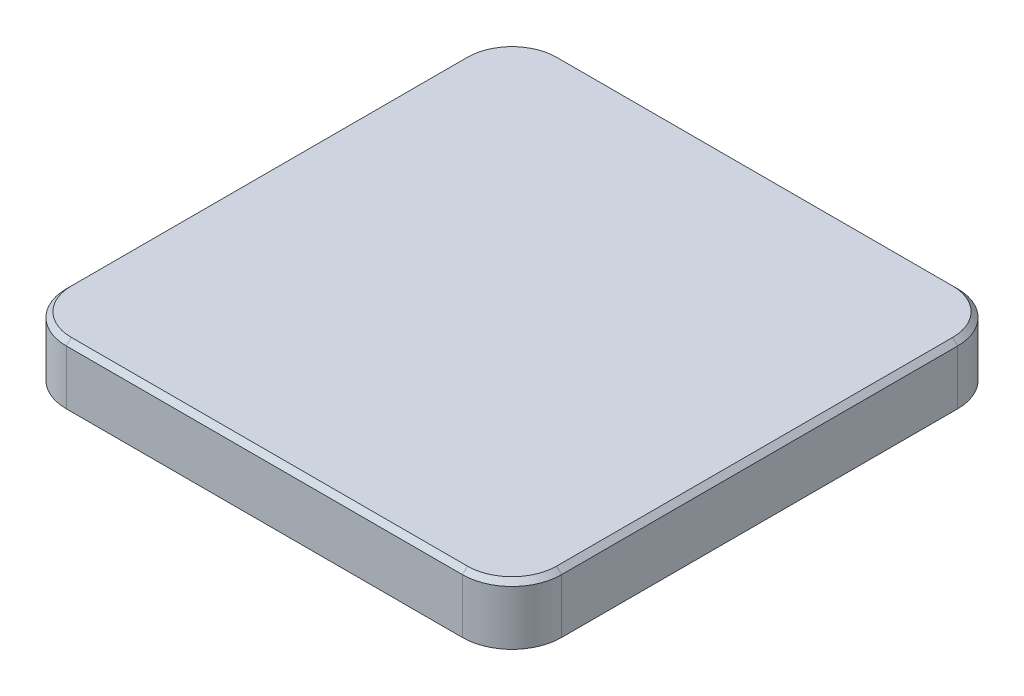
ISO-10303-21;
HEADER;
FILE_DESCRIPTION(('STEP AP214'),'2;1');
FILE_NAME('part.step','',(''),(''),'','','');
FILE_SCHEMA(('AUTOMOTIVE_DESIGN { 1 0 10303 214 1 1 1 1 }'));
ENDSEC;
DATA;
#1=APPLICATION_CONTEXT('core data for automotive mechanical design processes');
#2=APPLICATION_PROTOCOL_DEFINITION('international standard','automotive_design',2000,#1);
#3=PRODUCT_CONTEXT('',#1,'mechanical');
#4=PRODUCT('Part','Part','',(#3));
#5=PRODUCT_RELATED_PRODUCT_CATEGORY('part','',(#4));
#6=PRODUCT_DEFINITION_FORMATION('','',#4);
#7=PRODUCT_DEFINITION_CONTEXT('part definition',#1,'design');
#8=PRODUCT_DEFINITION('design','',#6,#7);
#9=PRODUCT_DEFINITION_SHAPE('','',#8);
#10=(LENGTH_UNIT() NAMED_UNIT(*) SI_UNIT(.MILLI.,.METRE.));
#11=(NAMED_UNIT(*) PLANE_ANGLE_UNIT() SI_UNIT($,.RADIAN.));
#12=(NAMED_UNIT(*) SI_UNIT($,.STERADIAN.) SOLID_ANGLE_UNIT());
#13=UNCERTAINTY_MEASURE_WITH_UNIT(LENGTH_MEASURE(1.E-05),#10,'distance_accuracy_value','');
#14=(GEOMETRIC_REPRESENTATION_CONTEXT(3) GLOBAL_UNCERTAINTY_ASSIGNED_CONTEXT((#13)) GLOBAL_UNIT_ASSIGNED_CONTEXT((#10,
#11,#12)) REPRESENTATION_CONTEXT('',''));
#15=CARTESIAN_POINT('',(0.,0.,0.));
#16=DIRECTION('',(0.,0.,1.));
#17=DIRECTION('',(1.,0.,0.));
#18=AXIS2_PLACEMENT_3D('',#15,#16,#17);
#19=CARTESIAN_POINT('',(40.,12.,-40.));
#20=DIRECTION('',(0.,-1.,0.));
#21=DIRECTION('',(0.,0.,-1.));
#22=AXIS2_PLACEMENT_3D('',#19,#20,#21);
#23=CYLINDRICAL_SURFACE('',#22,10.);
#24=DIRECTION('',(0.,-1.,0.));
#25=VECTOR('',#24,1.);
#26=CARTESIAN_POINT('',(39.9999999999999,12.,-50.));
#27=LINE('',#26,#25);
#28=CARTESIAN_POINT('',(39.9999999999999,11.,-50.));
#29=VERTEX_POINT('',#28);
#30=CARTESIAN_POINT('',(39.9999999999999,0.,-50.));
#31=VERTEX_POINT('',#30);
#32=EDGE_CURVE('E125',#29,#31,#27,.T.);
#33=ORIENTED_EDGE('',*,*,#32,.F.);
#34=CARTESIAN_POINT('',(40.,11.,-40.));
#35=DIRECTION('',(0.,-1.,0.));
#36=DIRECTION('',(0.,0.,-1.));
#37=AXIS2_PLACEMENT_3D('',#34,#35,#36);
#38=CIRCLE('',#37,10.);
#39=CARTESIAN_POINT('',(50.,11.,-39.9999999999999));
#40=VERTEX_POINT('',#39);
#41=EDGE_CURVE('E198',#29,#40,#38,.T.);
#42=ORIENTED_EDGE('',*,*,#41,.T.);
#43=DIRECTION('',(0.,-1.,0.));
#44=VECTOR('',#43,1.);
#45=CARTESIAN_POINT('',(50.,12.,-39.9999999999999));
#46=LINE('',#45,#44);
#47=CARTESIAN_POINT('',(50.,0.,-39.9999999999999));
#48=VERTEX_POINT('',#47);
#49=EDGE_CURVE('E149',#40,#48,#46,.T.);
#50=ORIENTED_EDGE('',*,*,#49,.T.);
#51=CARTESIAN_POINT('',(40.,0.,-40.));
#52=DIRECTION('',(0.,1.,0.));
#53=DIRECTION('',(0.,0.,-1.));
#54=AXIS2_PLACEMENT_3D('',#51,#52,#53);
#55=CIRCLE('',#54,10.);
#56=EDGE_CURVE('E144',#48,#31,#55,.T.);
#57=ORIENTED_EDGE('',*,*,#56,.T.);
#58=EDGE_LOOP('',(#33,#42,#50,#57));
#59=FACE_BOUND('',#58,.T.);
#60=ADVANCED_FACE('F35',(#59),#23,.T.);
#61=CARTESIAN_POINT('',(-40.,12.,-50.));
#62=DIRECTION('',(0.,0.,1.));
#63=DIRECTION('',(1.,0.,0.));
#64=AXIS2_PLACEMENT_3D('',#61,#62,#63);
#65=PLANE('',#64);
#66=DIRECTION('',(0.,-1.,0.));
#67=VECTOR('',#66,1.);
#68=CARTESIAN_POINT('',(-40.,12.,-50.));
#69=LINE('',#68,#67);
#70=CARTESIAN_POINT('',(-40.,11.,-50.));
#71=VERTEX_POINT('',#70);
#72=CARTESIAN_POINT('',(-40.,0.,-50.));
#73=VERTEX_POINT('',#72);
#74=EDGE_CURVE('E138',#71,#73,#69,.T.);
#75=ORIENTED_EDGE('',*,*,#74,.F.);
#76=DIRECTION('',(1.,0.,0.));
#77=VECTOR('',#76,1.);
#78=CARTESIAN_POINT('',(-40.,11.,-50.));
#79=LINE('',#78,#77);
#80=EDGE_CURVE('E132',#71,#29,#79,.T.);
#81=ORIENTED_EDGE('',*,*,#80,.T.);
#82=ORIENTED_EDGE('',*,*,#32,.T.);
#83=DIRECTION('',(-1.,0.,0.));
#84=VECTOR('',#83,1.);
#85=CARTESIAN_POINT('',(-40.,0.,-50.));
#86=LINE('',#85,#84);
#87=EDGE_CURVE('E129',#31,#73,#86,.T.);
#88=ORIENTED_EDGE('',*,*,#87,.T.);
#89=EDGE_LOOP('',(#75,#81,#82,#88));
#90=FACE_BOUND('',#89,.T.);
#91=ADVANCED_FACE('F128',(#90),#65,.F.);
#92=CARTESIAN_POINT('',(-40.,12.,-40.));
#93=DIRECTION('',(0.,-1.,0.));
#94=DIRECTION('',(0.,0.,-1.));
#95=AXIS2_PLACEMENT_3D('',#92,#93,#94);
#96=CYLINDRICAL_SURFACE('',#95,10.);
#97=DIRECTION('',(0.,-1.,0.));
#98=VECTOR('',#97,1.);
#99=CARTESIAN_POINT('',(-50.,12.,-39.9999999999999));
#100=LINE('',#99,#98);
#101=CARTESIAN_POINT('',(-50.,11.,-39.9999999999999));
#102=VERTEX_POINT('',#101);
#103=CARTESIAN_POINT('',(-50.,0.,-39.9999999999999));
#104=VERTEX_POINT('',#103);
#105=EDGE_CURVE('E179',#102,#104,#100,.T.);
#106=ORIENTED_EDGE('',*,*,#105,.F.);
#107=CARTESIAN_POINT('',(-40.,11.,-40.));
#108=DIRECTION('',(0.,-1.,0.));
#109=DIRECTION('',(0.,0.,-1.));
#110=AXIS2_PLACEMENT_3D('',#107,#108,#109);
#111=CIRCLE('',#110,10.);
#112=EDGE_CURVE('E201',#102,#71,#111,.T.);
#113=ORIENTED_EDGE('',*,*,#112,.T.);
#114=ORIENTED_EDGE('',*,*,#74,.T.);
#115=CARTESIAN_POINT('',(-40.,0.,-40.));
#116=DIRECTION('',(0.,1.,0.));
#117=DIRECTION('',(0.,0.,1.));
#118=AXIS2_PLACEMENT_3D('',#115,#116,#117);
#119=CIRCLE('',#118,10.);
#120=EDGE_CURVE('E147',#73,#104,#119,.T.);
#121=ORIENTED_EDGE('',*,*,#120,.T.);
#122=EDGE_LOOP('',(#106,#113,#114,#121));
#123=FACE_BOUND('',#122,.T.);
#124=ADVANCED_FACE('F269',(#123),#96,.T.);
#125=CARTESIAN_POINT('',(-50.,12.,-39.9999999999999));
#126=DIRECTION('',(1.,0.,0.));
#127=DIRECTION('',(0.,0.,-1.));
#128=AXIS2_PLACEMENT_3D('',#125,#126,#127);
#129=PLANE('',#128);
#130=DIRECTION('',(0.,-1.,0.));
#131=VECTOR('',#130,1.);
#132=CARTESIAN_POINT('',(-50.,12.,39.9999999999999));
#133=LINE('',#132,#131);
#134=CARTESIAN_POINT('',(-50.,11.,39.9999999999999));
#135=VERTEX_POINT('',#134);
#136=CARTESIAN_POINT('',(-50.,0.,39.9999999999999));
#137=VERTEX_POINT('',#136);
#138=EDGE_CURVE('E177',#135,#137,#133,.T.);
#139=ORIENTED_EDGE('',*,*,#138,.F.);
#140=DIRECTION('',(0.,0.,-1.));
#141=VECTOR('',#140,1.);
#142=CARTESIAN_POINT('',(-50.,11.,-39.9999999999999));
#143=LINE('',#142,#141);
#144=EDGE_CURVE('E203',#135,#102,#143,.T.);
#145=ORIENTED_EDGE('',*,*,#144,.T.);
#146=ORIENTED_EDGE('',*,*,#105,.T.);
#147=DIRECTION('',(0.,0.,1.));
#148=VECTOR('',#147,1.);
#149=CARTESIAN_POINT('',(-50.,0.,-39.9999999999999));
#150=LINE('',#149,#148);
#151=EDGE_CURVE('E156',#104,#137,#150,.T.);
#152=ORIENTED_EDGE('',*,*,#151,.T.);
#153=EDGE_LOOP('',(#139,#145,#146,#152));
#154=FACE_BOUND('',#153,.T.);
#155=ADVANCED_FACE('F266',(#154),#129,.F.);
#156=CARTESIAN_POINT('',(-40.,12.,40.));
#157=DIRECTION('',(0.,-1.,0.));
#158=DIRECTION('',(0.,0.,-1.));
#159=AXIS2_PLACEMENT_3D('',#156,#157,#158);
#160=CYLINDRICAL_SURFACE('',#159,10.);
#161=DIRECTION('',(0.,-1.,0.));
#162=VECTOR('',#161,1.);
#163=CARTESIAN_POINT('',(-40.,12.,50.));
#164=LINE('',#163,#162);
#165=CARTESIAN_POINT('',(-40.,11.,50.));
#166=VERTEX_POINT('',#165);
#167=CARTESIAN_POINT('',(-40.,0.,50.));
#168=VERTEX_POINT('',#167);
#169=EDGE_CURVE('E175',#166,#168,#164,.T.);
#170=ORIENTED_EDGE('',*,*,#169,.F.);
#171=CARTESIAN_POINT('',(-40.,11.,40.));
#172=DIRECTION('',(0.,-1.,0.));
#173=DIRECTION('',(0.,0.,-1.));
#174=AXIS2_PLACEMENT_3D('',#171,#172,#173);
#175=CIRCLE('',#174,10.);
#176=EDGE_CURVE('E205',#166,#135,#175,.T.);
#177=ORIENTED_EDGE('',*,*,#176,.T.);
#178=ORIENTED_EDGE('',*,*,#138,.T.);
#179=CARTESIAN_POINT('',(-40.,0.,40.));
#180=DIRECTION('',(0.,1.,0.));
#181=DIRECTION('',(0.,0.,1.));
#182=AXIS2_PLACEMENT_3D('',#179,#180,#181);
#183=CIRCLE('',#182,10.);
#184=EDGE_CURVE('E159',#137,#168,#183,.T.);
#185=ORIENTED_EDGE('',*,*,#184,.T.);
#186=EDGE_LOOP('',(#170,#177,#178,#185));
#187=FACE_BOUND('',#186,.T.);
#188=ADVANCED_FACE('F263',(#187),#160,.T.);
#189=CARTESIAN_POINT('',(-39.9999999999999,12.,50.));
#190=DIRECTION('',(0.,0.,-1.));
#191=DIRECTION('',(-1.,0.,0.));
#192=AXIS2_PLACEMENT_3D('',#189,#190,#191);
#193=PLANE('',#192);
#194=DIRECTION('',(0.,-1.,0.));
#195=VECTOR('',#194,1.);
#196=CARTESIAN_POINT('',(39.9999999999999,12.,50.));
#197=LINE('',#196,#195);
#198=CARTESIAN_POINT('',(39.9999999999999,11.,50.));
#199=VERTEX_POINT('',#198);
#200=CARTESIAN_POINT('',(39.9999999999999,0.,50.));
#201=VERTEX_POINT('',#200);
#202=EDGE_CURVE('E173',#199,#201,#197,.T.);
#203=ORIENTED_EDGE('',*,*,#202,.F.);
#204=DIRECTION('',(-1.,0.,0.));
#205=VECTOR('',#204,1.);
#206=CARTESIAN_POINT('',(-39.9999999999999,11.,50.));
#207=LINE('',#206,#205);
#208=EDGE_CURVE('E207',#199,#166,#207,.T.);
#209=ORIENTED_EDGE('',*,*,#208,.T.);
#210=ORIENTED_EDGE('',*,*,#169,.T.);
#211=DIRECTION('',(1.,0.,0.));
#212=VECTOR('',#211,1.);
#213=CARTESIAN_POINT('',(-39.9999999999999,0.,50.));
#214=LINE('',#213,#212);
#215=EDGE_CURVE('E162',#168,#201,#214,.T.);
#216=ORIENTED_EDGE('',*,*,#215,.T.);
#217=EDGE_LOOP('',(#203,#209,#210,#216));
#218=FACE_BOUND('',#217,.T.);
#219=ADVANCED_FACE('F260',(#218),#193,.F.);
#220=CARTESIAN_POINT('',(40.,12.,40.));
#221=DIRECTION('',(0.,-1.,0.));
#222=DIRECTION('',(0.,0.,-1.));
#223=AXIS2_PLACEMENT_3D('',#220,#221,#222);
#224=CYLINDRICAL_SURFACE('',#223,10.);
#225=DIRECTION('',(0.,-1.,0.));
#226=VECTOR('',#225,1.);
#227=CARTESIAN_POINT('',(50.,12.,39.9999999999999));
#228=LINE('',#227,#226);
#229=CARTESIAN_POINT('',(50.,11.,39.9999999999999));
#230=VERTEX_POINT('',#229);
#231=CARTESIAN_POINT('',(50.,0.,39.9999999999999));
#232=VERTEX_POINT('',#231);
#233=EDGE_CURVE('E171',#230,#232,#228,.T.);
#234=ORIENTED_EDGE('',*,*,#233,.F.);
#235=CARTESIAN_POINT('',(40.,11.,40.));
#236=DIRECTION('',(0.,-1.,0.));
#237=DIRECTION('',(0.,0.,-1.));
#238=AXIS2_PLACEMENT_3D('',#235,#236,#237);
#239=CIRCLE('',#238,10.);
#240=EDGE_CURVE('E45',#230,#199,#239,.T.);
#241=ORIENTED_EDGE('',*,*,#240,.T.);
#242=ORIENTED_EDGE('',*,*,#202,.T.);
#243=CARTESIAN_POINT('',(40.,0.,40.));
#244=DIRECTION('',(0.,1.,0.));
#245=DIRECTION('',(0.,0.,1.));
#246=AXIS2_PLACEMENT_3D('',#243,#244,#245);
#247=CIRCLE('',#246,10.);
#248=EDGE_CURVE('E165',#201,#232,#247,.T.);
#249=ORIENTED_EDGE('',*,*,#248,.T.);
#250=EDGE_LOOP('',(#234,#241,#242,#249));
#251=FACE_BOUND('',#250,.T.);
#252=ADVANCED_FACE('F257',(#251),#224,.T.);
#253=CARTESIAN_POINT('',(50.,12.,-39.9999999999999));
#254=DIRECTION('',(-1.,0.,0.));
#255=DIRECTION('',(0.,0.,1.));
#256=AXIS2_PLACEMENT_3D('',#253,#254,#255);
#257=PLANE('',#256);
#258=ORIENTED_EDGE('',*,*,#49,.F.);
#259=DIRECTION('',(0.,0.,1.));
#260=VECTOR('',#259,1.);
#261=CARTESIAN_POINT('',(50.,11.,-39.9999999999999));
#262=LINE('',#261,#260);
#263=EDGE_CURVE('E11',#40,#230,#262,.T.);
#264=ORIENTED_EDGE('',*,*,#263,.T.);
#265=ORIENTED_EDGE('',*,*,#233,.T.);
#266=DIRECTION('',(0.,0.,-1.));
#267=VECTOR('',#266,1.);
#268=CARTESIAN_POINT('',(50.,0.,-39.9999999999999));
#269=LINE('',#268,#267);
#270=EDGE_CURVE('E168',#232,#48,#269,.T.);
#271=ORIENTED_EDGE('',*,*,#270,.T.);
#272=EDGE_LOOP('',(#258,#264,#265,#271));
#273=FACE_BOUND('',#272,.T.);
#274=ADVANCED_FACE('F253',(#273),#257,.F.);
#275=CARTESIAN_POINT('',(40.,12.,-40.));
#276=DIRECTION('',(0.,-1.,0.));
#277=DIRECTION('',(0.,0.,-1.));
#278=AXIS2_PLACEMENT_3D('',#275,#276,#277);
#279=PLANE('',#278);
#280=DIRECTION('',(0.,0.,-1.));
#281=VECTOR('',#280,1.);
#282=CARTESIAN_POINT('',(49.,12.,-40.));
#283=LINE('',#282,#281);
#284=CARTESIAN_POINT('',(49.,12.,39.9999999999999));
#285=VERTEX_POINT('',#284);
#286=CARTESIAN_POINT('',(49.,12.,-39.9999999999999));
#287=VERTEX_POINT('',#286);
#288=EDGE_CURVE('E137',#285,#287,#283,.T.);
#289=ORIENTED_EDGE('',*,*,#288,.T.);
#290=CARTESIAN_POINT('',(40.,12.,-40.));
#291=DIRECTION('',(0.,-1.,0.));
#292=DIRECTION('',(0.,0.,-1.));
#293=AXIS2_PLACEMENT_3D('',#290,#291,#292);
#294=CIRCLE('',#293,9.00000000000001);
#295=CARTESIAN_POINT('',(39.9999999999999,12.,-49.));
#296=VERTEX_POINT('',#295);
#297=EDGE_CURVE('E195',#287,#296,#294,.F.);
#298=ORIENTED_EDGE('',*,*,#297,.T.);
#299=DIRECTION('',(-1.,0.,0.));
#300=VECTOR('',#299,1.);
#301=CARTESIAN_POINT('',(40.,12.,-49.));
#302=LINE('',#301,#300);
#303=CARTESIAN_POINT('',(-40.,12.,-49.));
#304=VERTEX_POINT('',#303);
#305=EDGE_CURVE('E193',#296,#304,#302,.T.);
#306=ORIENTED_EDGE('',*,*,#305,.T.);
#307=CARTESIAN_POINT('',(-40.,12.,-40.));
#308=DIRECTION('',(0.,-1.,0.));
#309=DIRECTION('',(0.,0.,-1.));
#310=AXIS2_PLACEMENT_3D('',#307,#308,#309);
#311=CIRCLE('',#310,9.00000000000001);
#312=CARTESIAN_POINT('',(-49.,12.,-39.9999999999999));
#313=VERTEX_POINT('',#312);
#314=EDGE_CURVE('E191',#304,#313,#311,.F.);
#315=ORIENTED_EDGE('',*,*,#314,.T.);
#316=DIRECTION('',(0.,0.,1.));
#317=VECTOR('',#316,1.);
#318=CARTESIAN_POINT('',(-49.,12.,-40.));
#319=LINE('',#318,#317);
#320=CARTESIAN_POINT('',(-49.,12.,39.9999999999999));
#321=VERTEX_POINT('',#320);
#322=EDGE_CURVE('E189',#313,#321,#319,.T.);
#323=ORIENTED_EDGE('',*,*,#322,.T.);
#324=CARTESIAN_POINT('',(-40.,12.,40.));
#325=DIRECTION('',(0.,-1.,0.));
#326=DIRECTION('',(0.,0.,-1.));
#327=AXIS2_PLACEMENT_3D('',#324,#325,#326);
#328=CIRCLE('',#327,9.00000000000001);
#329=CARTESIAN_POINT('',(-40.,12.,49.));
#330=VERTEX_POINT('',#329);
#331=EDGE_CURVE('E187',#321,#330,#328,.F.);
#332=ORIENTED_EDGE('',*,*,#331,.T.);
#333=DIRECTION('',(1.,0.,0.));
#334=VECTOR('',#333,1.);
#335=CARTESIAN_POINT('',(40.,12.,49.));
#336=LINE('',#335,#334);
#337=CARTESIAN_POINT('',(39.9999999999999,12.,49.));
#338=VERTEX_POINT('',#337);
#339=EDGE_CURVE('E185',#330,#338,#336,.T.);
#340=ORIENTED_EDGE('',*,*,#339,.T.);
#341=CARTESIAN_POINT('',(40.,12.,40.));
#342=DIRECTION('',(0.,-1.,0.));
#343=DIRECTION('',(0.,0.,-1.));
#344=AXIS2_PLACEMENT_3D('',#341,#342,#343);
#345=CIRCLE('',#344,9.00000000000001);
#346=EDGE_CURVE('E183',#338,#285,#345,.F.);
#347=ORIENTED_EDGE('',*,*,#346,.T.);
#348=EDGE_LOOP('',(#289,#298,#306,#315,#323,#332,#340,#347));
#349=FACE_BOUND('',#348,.T.);
#350=ADVANCED_FACE('F238',(#349),#279,.F.);
#351=CARTESIAN_POINT('',(40.,0.,-40.));
#352=DIRECTION('',(0.,-1.,0.));
#353=DIRECTION('',(0.,0.,-1.));
#354=AXIS2_PLACEMENT_3D('',#351,#352,#353);
#355=PLANE('',#354);
#356=ORIENTED_EDGE('',*,*,#56,.F.);
#357=ORIENTED_EDGE('',*,*,#270,.F.);
#358=ORIENTED_EDGE('',*,*,#248,.F.);
#359=ORIENTED_EDGE('',*,*,#215,.F.);
#360=ORIENTED_EDGE('',*,*,#184,.F.);
#361=ORIENTED_EDGE('',*,*,#151,.F.);
#362=ORIENTED_EDGE('',*,*,#120,.F.);
#363=ORIENTED_EDGE('',*,*,#87,.F.);
#364=EDGE_LOOP('',(#356,#357,#358,#359,#360,#361,#362,#363));
#365=FACE_BOUND('',#364,.T.);
#366=ADVANCED_FACE('F142',(#365),#355,.T.);
#367=CARTESIAN_POINT('',(-40.,12.,40.));
#368=DIRECTION('',(0.,-1.,0.));
#369=DIRECTION('',(0.,0.,-1.));
#370=AXIS2_PLACEMENT_3D('',#367,#368,#369);
#371=CONICAL_SURFACE('',#370,9.00000000000001,0.785398163397443);
#372=DIRECTION('',(0.707106781186543,0.707106781186552,0.));
#373=VECTOR('',#372,1.);
#374=CARTESIAN_POINT('',(-50.,11.,39.9999999999999));
#375=LINE('',#374,#373);
#376=EDGE_CURVE('E153',#135,#321,#375,.T.);
#377=ORIENTED_EDGE('',*,*,#376,.F.);
#378=ORIENTED_EDGE('',*,*,#176,.F.);
#379=DIRECTION('',(0.,-0.707106781186552,0.707106781186543));
#380=VECTOR('',#379,1.);
#381=CARTESIAN_POINT('',(-40.,12.,49.));
#382=LINE('',#381,#380);
#383=EDGE_CURVE('E40',#330,#166,#382,.T.);
#384=ORIENTED_EDGE('',*,*,#383,.F.);
#385=ORIENTED_EDGE('',*,*,#331,.F.);
#386=EDGE_LOOP('',(#377,#378,#384,#385));
#387=FACE_BOUND('',#386,.T.);
#388=ADVANCED_FACE('F38',(#387),#371,.T.);
#389=CARTESIAN_POINT('',(40.,12.,49.));
#390=DIRECTION('',(0.,-0.70710678118654,-0.707106781186555));
#391=DIRECTION('',(1.,0.,0.));
#392=AXIS2_PLACEMENT_3D('',#389,#390,#391);
#393=PLANE('',#392);
#394=ORIENTED_EDGE('',*,*,#383,.T.);
#395=ORIENTED_EDGE('',*,*,#208,.F.);
#396=DIRECTION('',(0.,-0.707106781186555,0.70710678118654));
#397=VECTOR('',#396,1.);
#398=CARTESIAN_POINT('',(39.9999999999999,12.,49.));
#399=LINE('',#398,#397);
#400=EDGE_CURVE('E223',#338,#199,#399,.T.);
#401=ORIENTED_EDGE('',*,*,#400,.F.);
#402=ORIENTED_EDGE('',*,*,#339,.F.);
#403=EDGE_LOOP('',(#394,#395,#401,#402));
#404=FACE_BOUND('',#403,.T.);
#405=ADVANCED_FACE('F317',(#404),#393,.F.);
#406=CARTESIAN_POINT('',(-49.,12.,-40.));
#407=DIRECTION('',(0.707106781186552,-0.707106781186543,0.));
#408=DIRECTION('',(0.,0.,1.));
#409=AXIS2_PLACEMENT_3D('',#406,#407,#408);
#410=PLANE('',#409);
#411=ORIENTED_EDGE('',*,*,#376,.T.);
#412=ORIENTED_EDGE('',*,*,#322,.F.);
#413=DIRECTION('',(0.707106781186543,0.707106781186552,0.));
#414=VECTOR('',#413,1.);
#415=CARTESIAN_POINT('',(-50.,11.,-39.9999999999999));
#416=LINE('',#415,#414);
#417=EDGE_CURVE('E220',#102,#313,#416,.T.);
#418=ORIENTED_EDGE('',*,*,#417,.F.);
#419=ORIENTED_EDGE('',*,*,#144,.F.);
#420=EDGE_LOOP('',(#411,#412,#418,#419));
#421=FACE_BOUND('',#420,.T.);
#422=ADVANCED_FACE('F230',(#421),#410,.F.);
#423=CARTESIAN_POINT('',(40.,12.,40.));
#424=DIRECTION('',(0.,-1.,0.));
#425=DIRECTION('',(0.,0.,-1.));
#426=AXIS2_PLACEMENT_3D('',#423,#424,#425);
#427=CONICAL_SURFACE('',#426,9.00000000000001,0.785398163397441);
#428=ORIENTED_EDGE('',*,*,#400,.T.);
#429=ORIENTED_EDGE('',*,*,#240,.F.);
#430=DIRECTION('',(0.707106781186543,-0.707106781186552,0.));
#431=VECTOR('',#430,1.);
#432=CARTESIAN_POINT('',(49.,12.,39.9999999999999));
#433=LINE('',#432,#431);
#434=EDGE_CURVE('E217',#285,#230,#433,.T.);
#435=ORIENTED_EDGE('',*,*,#434,.F.);
#436=ORIENTED_EDGE('',*,*,#346,.F.);
#437=EDGE_LOOP('',(#428,#429,#435,#436));
#438=FACE_BOUND('',#437,.T.);
#439=ADVANCED_FACE('F306',(#438),#427,.T.);
#440=CARTESIAN_POINT('',(-40.,12.,-40.));
#441=DIRECTION('',(0.,-1.,0.));
#442=DIRECTION('',(0.,0.,-1.));
#443=AXIS2_PLACEMENT_3D('',#440,#441,#442);
#444=CONICAL_SURFACE('',#443,9.00000000000001,0.785398163397441);
#445=ORIENTED_EDGE('',*,*,#417,.T.);
#446=ORIENTED_EDGE('',*,*,#314,.F.);
#447=DIRECTION('',(0.,0.707106781186552,0.707106781186543));
#448=VECTOR('',#447,1.);
#449=CARTESIAN_POINT('',(-40.,11.,-50.));
#450=LINE('',#449,#448);
#451=EDGE_CURVE('E214',#71,#304,#450,.T.);
#452=ORIENTED_EDGE('',*,*,#451,.F.);
#453=ORIENTED_EDGE('',*,*,#112,.F.);
#454=EDGE_LOOP('',(#445,#446,#452,#453));
#455=FACE_BOUND('',#454,.T.);
#456=ADVANCED_FACE('F244',(#455),#444,.T.);
#457=CARTESIAN_POINT('',(49.,12.,-40.));
#458=DIRECTION('',(-0.707106781186552,-0.707106781186543,0.));
#459=DIRECTION('',(0.,0.,-1.));
#460=AXIS2_PLACEMENT_3D('',#457,#458,#459);
#461=PLANE('',#460);
#462=ORIENTED_EDGE('',*,*,#434,.T.);
#463=ORIENTED_EDGE('',*,*,#263,.F.);
#464=DIRECTION('',(0.707106781186543,-0.707106781186552,0.));
#465=VECTOR('',#464,1.);
#466=CARTESIAN_POINT('',(49.,12.,-39.9999999999999));
#467=LINE('',#466,#465);
#468=EDGE_CURVE('E212',#287,#40,#467,.T.);
#469=ORIENTED_EDGE('',*,*,#468,.F.);
#470=ORIENTED_EDGE('',*,*,#288,.F.);
#471=EDGE_LOOP('',(#462,#463,#469,#470));
#472=FACE_BOUND('',#471,.T.);
#473=ADVANCED_FACE('F294',(#472),#461,.F.);
#474=CARTESIAN_POINT('',(40.,12.,-49.));
#475=DIRECTION('',(0.,-0.707106781186543,0.707106781186552));
#476=DIRECTION('',(-1.,0.,0.));
#477=AXIS2_PLACEMENT_3D('',#474,#475,#476);
#478=PLANE('',#477);
#479=ORIENTED_EDGE('',*,*,#451,.T.);
#480=ORIENTED_EDGE('',*,*,#305,.F.);
#481=DIRECTION('',(0.,0.707106781186552,0.707106781186543));
#482=VECTOR('',#481,1.);
#483=CARTESIAN_POINT('',(39.9999999999999,11.,-50.));
#484=LINE('',#483,#482);
#485=EDGE_CURVE('E210',#29,#296,#484,.T.);
#486=ORIENTED_EDGE('',*,*,#485,.F.);
#487=ORIENTED_EDGE('',*,*,#80,.F.);
#488=EDGE_LOOP('',(#479,#480,#486,#487));
#489=FACE_BOUND('',#488,.T.);
#490=ADVANCED_FACE('F247',(#489),#478,.F.);
#491=CARTESIAN_POINT('',(40.,12.,-40.));
#492=DIRECTION('',(0.,-1.,0.));
#493=DIRECTION('',(0.,0.,-1.));
#494=AXIS2_PLACEMENT_3D('',#491,#492,#493);
#495=CONICAL_SURFACE('',#494,9.00000000000001,0.785398163397443);
#496=ORIENTED_EDGE('',*,*,#468,.T.);
#497=ORIENTED_EDGE('',*,*,#41,.F.);
#498=ORIENTED_EDGE('',*,*,#485,.T.);
#499=ORIENTED_EDGE('',*,*,#297,.F.);
#500=EDGE_LOOP('',(#496,#497,#498,#499));
#501=FACE_BOUND('',#500,.T.);
#502=ADVANCED_FACE('F251',(#501),#495,.T.);
#503=CLOSED_SHELL('',(#60,#91,#124,#155,#188,#219,#252,#274,#350,#366,#388,#405,#422,#439,#456,
#473,#490,#502));
#504=MANIFOLD_SOLID_BREP('B2',#503);
#505=ADVANCED_BREP_SHAPE_REPRESENTATION('',(#18,#504),#14);
#506=SHAPE_DEFINITION_REPRESENTATION(#9,#505);
ENDSEC;
END-ISO-10303-21;
